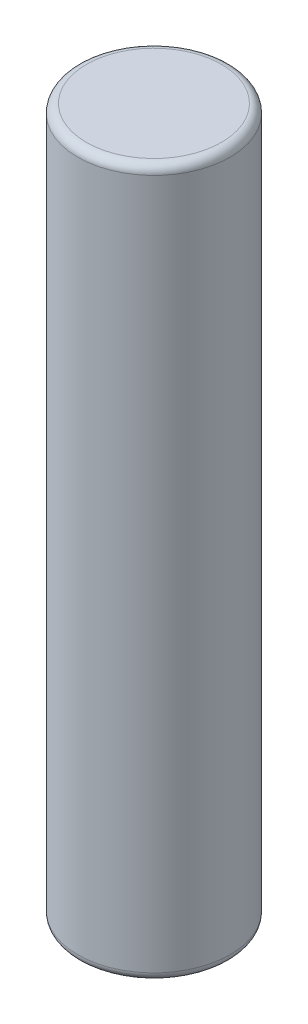
ISO-10303-21;
HEADER;
FILE_DESCRIPTION(('STEP AP214'),'2;1');
FILE_NAME('part.step','',(''),(''),'','','');
FILE_SCHEMA(('AUTOMOTIVE_DESIGN { 1 0 10303 214 1 1 1 1 }'));
ENDSEC;
DATA;
#1=APPLICATION_CONTEXT('core data for automotive mechanical design processes');
#2=APPLICATION_PROTOCOL_DEFINITION('international standard','automotive_design',2000,#1);
#3=PRODUCT_CONTEXT('',#1,'mechanical');
#4=PRODUCT('Part','Part','',(#3));
#5=PRODUCT_RELATED_PRODUCT_CATEGORY('part','',(#4));
#6=PRODUCT_DEFINITION_FORMATION('','',#4);
#7=PRODUCT_DEFINITION_CONTEXT('part definition',#1,'design');
#8=PRODUCT_DEFINITION('design','',#6,#7);
#9=PRODUCT_DEFINITION_SHAPE('','',#8);
#10=(LENGTH_UNIT() NAMED_UNIT(*) SI_UNIT(.MILLI.,.METRE.));
#11=(NAMED_UNIT(*) PLANE_ANGLE_UNIT() SI_UNIT($,.RADIAN.));
#12=(NAMED_UNIT(*) SI_UNIT($,.STERADIAN.) SOLID_ANGLE_UNIT());
#13=UNCERTAINTY_MEASURE_WITH_UNIT(LENGTH_MEASURE(1.E-05),#10,'distance_accuracy_value','');
#14=(GEOMETRIC_REPRESENTATION_CONTEXT(3) GLOBAL_UNCERTAINTY_ASSIGNED_CONTEXT((#13)) GLOBAL_UNIT_ASSIGNED_CONTEXT((#10,
#11,#12)) REPRESENTATION_CONTEXT('',''));
#15=CARTESIAN_POINT('',(0.,0.,0.));
#16=DIRECTION('',(0.,0.,1.));
#17=DIRECTION('',(1.,0.,0.));
#18=AXIS2_PLACEMENT_3D('',#15,#16,#17);
#19=CARTESIAN_POINT('',(0.,16.5,0.));
#20=DIRECTION('',(0.,-1.,0.));
#21=DIRECTION('',(0.,0.,-1.));
#22=AXIS2_PLACEMENT_3D('',#19,#20,#21);
#23=CYLINDRICAL_SURFACE('',#22,1.775);
#24=CARTESIAN_POINT('',(0.,0.199999999999999,0.));
#25=DIRECTION('',(0.,1.,0.));
#26=DIRECTION('',(0.,0.,1.));
#27=AXIS2_PLACEMENT_3D('',#24,#25,#26);
#28=CIRCLE('',#27,1.775);
#29=CARTESIAN_POINT('',(0.,0.199999999999999,1.775));
#30=VERTEX_POINT('',#29);
#31=EDGE_CURVE('E56',#30,#30,#28,.T.);
#32=ORIENTED_EDGE('',*,*,#31,.T.);
#33=EDGE_LOOP('',(#32));
#34=FACE_BOUND('',#33,.T.);
#35=CARTESIAN_POINT('',(0.,16.3,0.));
#36=DIRECTION('',(0.,1.,0.));
#37=DIRECTION('',(0.,0.,1.));
#38=AXIS2_PLACEMENT_3D('',#35,#36,#37);
#39=CIRCLE('',#38,1.775);
#40=CARTESIAN_POINT('',(0.,16.3,1.775));
#41=VERTEX_POINT('',#40);
#42=EDGE_CURVE('E61',#41,#41,#39,.F.);
#43=ORIENTED_EDGE('',*,*,#42,.T.);
#44=EDGE_LOOP('',(#43));
#45=FACE_BOUND('',#44,.T.);
#46=ADVANCED_FACE('F43',(#34,#45),#23,.T.);
#47=CARTESIAN_POINT('',(0.,16.5,0.));
#48=DIRECTION('',(0.,1.,0.));
#49=DIRECTION('',(0.,0.,1.));
#50=AXIS2_PLACEMENT_3D('',#47,#48,#49);
#51=PLANE('',#50);
#52=CARTESIAN_POINT('',(0.,16.5,0.));
#53=DIRECTION('',(0.,1.,0.));
#54=DIRECTION('',(0.,0.,1.));
#55=AXIS2_PLACEMENT_3D('',#52,#53,#54);
#56=CIRCLE('',#55,1.575);
#57=CARTESIAN_POINT('',(0.,16.5,1.575));
#58=VERTEX_POINT('',#57);
#59=EDGE_CURVE('E10',#58,#58,#56,.T.);
#60=ORIENTED_EDGE('',*,*,#59,.T.);
#61=EDGE_LOOP('',(#60));
#62=FACE_BOUND('',#61,.T.);
#63=ADVANCED_FACE('F78',(#62),#51,.T.);
#64=CARTESIAN_POINT('',(0.,0.,0.));
#65=DIRECTION('',(0.,1.,0.));
#66=DIRECTION('',(0.,0.,1.));
#67=AXIS2_PLACEMENT_3D('',#64,#65,#66);
#68=PLANE('',#67);
#69=CARTESIAN_POINT('',(0.,0.,0.));
#70=DIRECTION('',(0.,1.,0.));
#71=DIRECTION('',(0.,0.,1.));
#72=AXIS2_PLACEMENT_3D('',#69,#70,#71);
#73=CIRCLE('',#72,1.575);
#74=CARTESIAN_POINT('',(0.,0.,1.575));
#75=VERTEX_POINT('',#74);
#76=EDGE_CURVE('E51',#75,#75,#73,.F.);
#77=ORIENTED_EDGE('',*,*,#76,.T.);
#78=EDGE_LOOP('',(#77));
#79=FACE_BOUND('',#78,.T.);
#80=ADVANCED_FACE('F75',(#79),#68,.F.);
#81=CARTESIAN_POINT('',(0.,0.199999999999999,0.));
#82=DIRECTION('',(0.,1.,0.));
#83=DIRECTION('',(0.,0.,1.));
#84=AXIS2_PLACEMENT_3D('',#81,#82,#83);
#85=TOROIDAL_SURFACE('',#84,1.575,0.2);
#86=ORIENTED_EDGE('',*,*,#76,.F.);
#87=EDGE_LOOP('',(#86));
#88=FACE_BOUND('',#87,.T.);
#89=ORIENTED_EDGE('',*,*,#31,.F.);
#90=EDGE_LOOP('',(#89));
#91=FACE_BOUND('',#90,.T.);
#92=ADVANCED_FACE('F71',(#88,#91),#85,.T.);
#93=CARTESIAN_POINT('',(0.,16.3,0.));
#94=DIRECTION('',(0.,1.,0.));
#95=DIRECTION('',(0.,0.,1.));
#96=AXIS2_PLACEMENT_3D('',#93,#94,#95);
#97=TOROIDAL_SURFACE('',#96,1.575,0.2);
#98=ORIENTED_EDGE('',*,*,#42,.F.);
#99=EDGE_LOOP('',(#98));
#100=FACE_BOUND('',#99,.T.);
#101=ORIENTED_EDGE('',*,*,#59,.F.);
#102=EDGE_LOOP('',(#101));
#103=FACE_BOUND('',#102,.T.);
#104=ADVANCED_FACE('F45',(#100,#103),#97,.T.);
#105=CLOSED_SHELL('',(#46,#63,#80,#92,#104));
#106=MANIFOLD_SOLID_BREP('B2',#105);
#107=ADVANCED_BREP_SHAPE_REPRESENTATION('',(#18,#106),#14);
#108=SHAPE_DEFINITION_REPRESENTATION(#9,#107);
ENDSEC;
END-ISO-10303-21;
